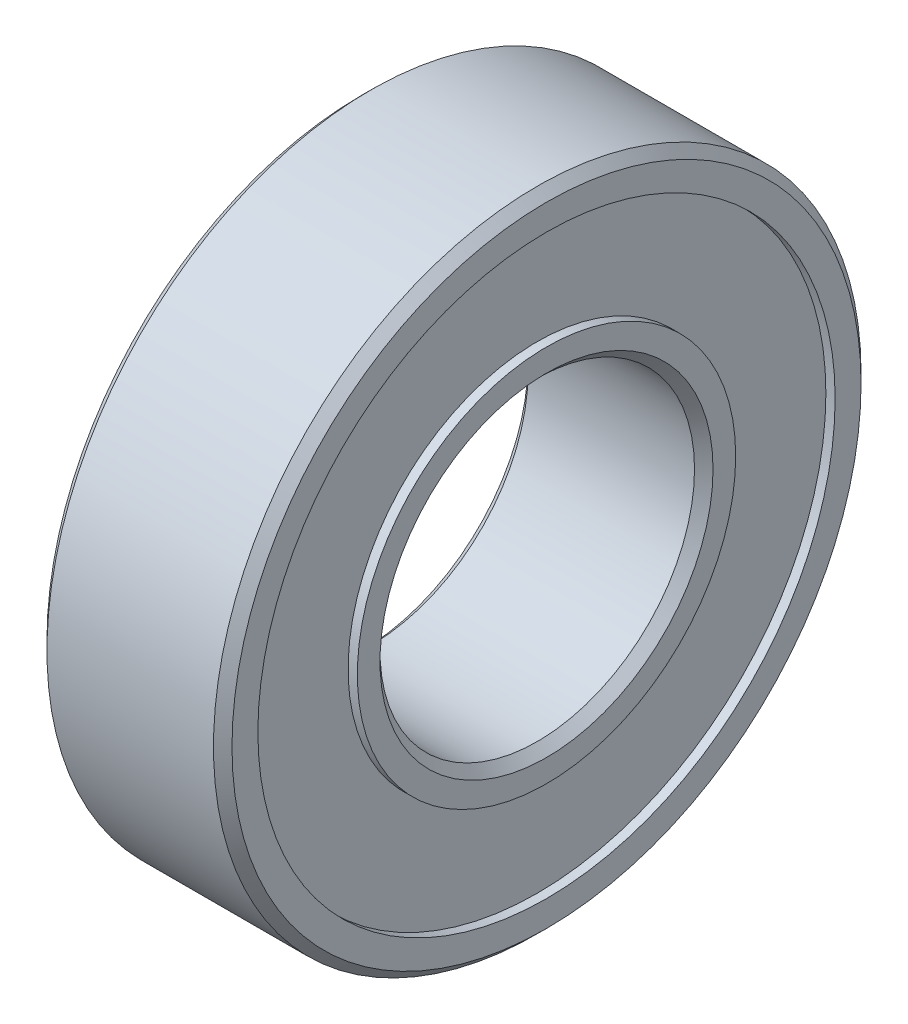
ISO-10303-21;
HEADER;
FILE_DESCRIPTION(('STEP AP214'),'2;1');
FILE_NAME('part.step','',(''),(''),'','','');
FILE_SCHEMA(('AUTOMOTIVE_DESIGN { 1 0 10303 214 1 1 1 1 }'));
ENDSEC;
DATA;
#1=APPLICATION_CONTEXT('core data for automotive mechanical design processes');
#2=APPLICATION_PROTOCOL_DEFINITION('international standard','automotive_design',2000,#1);
#3=PRODUCT_CONTEXT('',#1,'mechanical');
#4=PRODUCT('Part','Part','',(#3));
#5=PRODUCT_RELATED_PRODUCT_CATEGORY('part','',(#4));
#6=PRODUCT_DEFINITION_FORMATION('','',#4);
#7=PRODUCT_DEFINITION_CONTEXT('part definition',#1,'design');
#8=PRODUCT_DEFINITION('design','',#6,#7);
#9=PRODUCT_DEFINITION_SHAPE('','',#8);
#10=(LENGTH_UNIT() NAMED_UNIT(*) SI_UNIT(.MILLI.,.METRE.));
#11=(NAMED_UNIT(*) PLANE_ANGLE_UNIT() SI_UNIT($,.RADIAN.));
#12=(NAMED_UNIT(*) SI_UNIT($,.STERADIAN.) SOLID_ANGLE_UNIT());
#13=UNCERTAINTY_MEASURE_WITH_UNIT(LENGTH_MEASURE(1.E-05),#10,'distance_accuracy_value','');
#14=(GEOMETRIC_REPRESENTATION_CONTEXT(3) GLOBAL_UNCERTAINTY_ASSIGNED_CONTEXT((#13)) GLOBAL_UNIT_ASSIGNED_CONTEXT((#10,
#11,#12)) REPRESENTATION_CONTEXT('',''));
#15=CARTESIAN_POINT('',(0.,0.,0.));
#16=DIRECTION('',(0.,0.,1.));
#17=DIRECTION('',(1.,0.,0.));
#18=AXIS2_PLACEMENT_3D('',#15,#16,#17);
#19=CARTESIAN_POINT('',(0.,0.,0.));
#20=DIRECTION('',(1.,0.,0.));
#21=DIRECTION('',(0.,0.,-1.));
#22=AXIS2_PLACEMENT_3D('',#19,#20,#21);
#23=PLANE('',#22);
#24=CARTESIAN_POINT('',(0.,0.,0.));
#25=DIRECTION('',(1.,0.,0.));
#26=DIRECTION('',(0.,0.,-1.));
#27=AXIS2_PLACEMENT_3D('',#24,#25,#26);
#28=CIRCLE('',#27,9.00000000000001);
#29=CARTESIAN_POINT('',(0.,0.,-9.00000000000001));
#30=VERTEX_POINT('',#29);
#31=EDGE_CURVE('E60',#30,#30,#28,.T.);
#32=ORIENTED_EDGE('',*,*,#31,.T.);
#33=EDGE_LOOP('',(#32));
#34=FACE_BOUND('',#33,.T.);
#35=CARTESIAN_POINT('',(0.,0.,0.));
#36=DIRECTION('',(-1.,0.,0.));
#37=DIRECTION('',(0.,0.,1.));
#38=AXIS2_PLACEMENT_3D('',#35,#36,#37);
#39=CIRCLE('',#38,10.225);
#40=CARTESIAN_POINT('',(0.,0.,10.225));
#41=VERTEX_POINT('',#40);
#42=EDGE_CURVE('E85',#41,#41,#39,.T.);
#43=ORIENTED_EDGE('',*,*,#42,.T.);
#44=EDGE_LOOP('',(#43));
#45=FACE_BOUND('',#44,.T.);
#46=ADVANCED_FACE('F33',(#34,#45),#23,.F.);
#47=CARTESIAN_POINT('',(10.,0.,0.));
#48=DIRECTION('',(1.,0.,0.));
#49=DIRECTION('',(0.,0.,-1.));
#50=AXIS2_PLACEMENT_3D('',#47,#48,#49);
#51=PLANE('',#50);
#52=CARTESIAN_POINT('',(10.,0.,0.));
#53=DIRECTION('',(1.,0.,0.));
#54=DIRECTION('',(0.,0.,-1.));
#55=AXIS2_PLACEMENT_3D('',#52,#53,#54);
#56=CIRCLE('',#55,9.00000000000001);
#57=CARTESIAN_POINT('',(10.,0.,-9.00000000000001));
#58=VERTEX_POINT('',#57);
#59=EDGE_CURVE('E10',#58,#58,#56,.F.);
#60=ORIENTED_EDGE('',*,*,#59,.T.);
#61=EDGE_LOOP('',(#60));
#62=FACE_BOUND('',#61,.T.);
#63=CARTESIAN_POINT('',(10.,0.,0.));
#64=DIRECTION('',(1.,0.,0.));
#65=DIRECTION('',(0.,0.,-1.));
#66=AXIS2_PLACEMENT_3D('',#63,#64,#65);
#67=CIRCLE('',#66,10.225);
#68=CARTESIAN_POINT('',(10.,0.,-10.225));
#69=VERTEX_POINT('',#68);
#70=EDGE_CURVE('E73',#69,#69,#67,.T.);
#71=ORIENTED_EDGE('',*,*,#70,.T.);
#72=EDGE_LOOP('',(#71));
#73=FACE_BOUND('',#72,.T.);
#74=ADVANCED_FACE('F141',(#62,#73),#51,.T.);
#75=CARTESIAN_POINT('',(10.,0.,0.));
#76=DIRECTION('',(1.,0.,0.));
#77=DIRECTION('',(0.,0.,-1.));
#78=AXIS2_PLACEMENT_3D('',#75,#76,#77);
#79=CIRCLE('',#78,15.6);
#80=CARTESIAN_POINT('',(10.,0.,-15.6));
#81=VERTEX_POINT('',#80);
#82=EDGE_CURVE('E67',#81,#81,#79,.T.);
#83=ORIENTED_EDGE('',*,*,#82,.F.);
#84=EDGE_LOOP('',(#83));
#85=FACE_BOUND('',#84,.T.);
#86=CARTESIAN_POINT('',(10.,0.,0.));
#87=DIRECTION('',(1.,0.,0.));
#88=DIRECTION('',(0.,0.,-1.));
#89=AXIS2_PLACEMENT_3D('',#86,#87,#88);
#90=CIRCLE('',#89,17.);
#91=CARTESIAN_POINT('',(10.,0.,-17.));
#92=VERTEX_POINT('',#91);
#93=EDGE_CURVE('E41',#92,#92,#90,.T.);
#94=ORIENTED_EDGE('',*,*,#93,.T.);
#95=EDGE_LOOP('',(#94));
#96=FACE_BOUND('',#95,.T.);
#97=ADVANCED_FACE('F111',(#85,#96),#51,.T.);
#98=CARTESIAN_POINT('',(0.,0.,0.));
#99=DIRECTION('',(-1.,0.,0.));
#100=DIRECTION('',(0.,0.,1.));
#101=AXIS2_PLACEMENT_3D('',#98,#99,#100);
#102=CIRCLE('',#101,15.6);
#103=CARTESIAN_POINT('',(0.,0.,15.6));
#104=VERTEX_POINT('',#103);
#105=EDGE_CURVE('E79',#104,#104,#102,.T.);
#106=ORIENTED_EDGE('',*,*,#105,.F.);
#107=EDGE_LOOP('',(#106));
#108=FACE_BOUND('',#107,.T.);
#109=CARTESIAN_POINT('',(0.,0.,0.));
#110=DIRECTION('',(1.,0.,0.));
#111=DIRECTION('',(0.,0.,-1.));
#112=AXIS2_PLACEMENT_3D('',#109,#110,#111);
#113=CIRCLE('',#112,17.);
#114=CARTESIAN_POINT('',(0.,0.,-17.));
#115=VERTEX_POINT('',#114);
#116=EDGE_CURVE('E63',#115,#115,#113,.F.);
#117=ORIENTED_EDGE('',*,*,#116,.T.);
#118=EDGE_LOOP('',(#117));
#119=FACE_BOUND('',#118,.T.);
#120=ADVANCED_FACE('F107',(#108,#119),#23,.F.);
#121=CARTESIAN_POINT('',(10.,0.,0.));
#122=DIRECTION('',(-1.,0.,0.));
#123=DIRECTION('',(0.,0.,1.));
#124=AXIS2_PLACEMENT_3D('',#121,#122,#123);
#125=CYLINDRICAL_SURFACE('',#124,17.5);
#126=CARTESIAN_POINT('',(0.500000000000007,0.,0.));
#127=DIRECTION('',(1.,0.,0.));
#128=DIRECTION('',(0.,0.,-1.));
#129=AXIS2_PLACEMENT_3D('',#126,#127,#128);
#130=CIRCLE('',#129,17.5);
#131=CARTESIAN_POINT('',(0.500000000000007,0.,-17.5));
#132=VERTEX_POINT('',#131);
#133=EDGE_CURVE('E45',#132,#132,#130,.T.);
#134=ORIENTED_EDGE('',*,*,#133,.T.);
#135=EDGE_LOOP('',(#134));
#136=FACE_BOUND('',#135,.T.);
#137=CARTESIAN_POINT('',(9.5,0.,0.));
#138=DIRECTION('',(1.,0.,0.));
#139=DIRECTION('',(0.,0.,-1.));
#140=AXIS2_PLACEMENT_3D('',#137,#138,#139);
#141=CIRCLE('',#140,17.5);
#142=CARTESIAN_POINT('',(9.5,0.,-17.5));
#143=VERTEX_POINT('',#142);
#144=EDGE_CURVE('E49',#143,#143,#141,.F.);
#145=ORIENTED_EDGE('',*,*,#144,.T.);
#146=EDGE_LOOP('',(#145));
#147=FACE_BOUND('',#146,.T.);
#148=ADVANCED_FACE('F110',(#136,#147),#125,.T.);
#149=CARTESIAN_POINT('',(10.,0.,0.));
#150=DIRECTION('',(-1.,0.,0.));
#151=DIRECTION('',(0.,0.,1.));
#152=AXIS2_PLACEMENT_3D('',#149,#150,#151);
#153=CYLINDRICAL_SURFACE('',#152,8.5);
#154=CARTESIAN_POINT('',(0.500000000000007,0.,0.));
#155=DIRECTION('',(1.,0.,0.));
#156=DIRECTION('',(0.,0.,-1.));
#157=AXIS2_PLACEMENT_3D('',#154,#155,#156);
#158=CIRCLE('',#157,8.5);
#159=CARTESIAN_POINT('',(0.500000000000007,0.,-8.5));
#160=VERTEX_POINT('',#159);
#161=EDGE_CURVE('E54',#160,#160,#158,.F.);
#162=ORIENTED_EDGE('',*,*,#161,.T.);
#163=EDGE_LOOP('',(#162));
#164=FACE_BOUND('',#163,.T.);
#165=CARTESIAN_POINT('',(9.49999999999999,0.,0.));
#166=DIRECTION('',(1.,0.,0.));
#167=DIRECTION('',(0.,0.,-1.));
#168=AXIS2_PLACEMENT_3D('',#165,#166,#167);
#169=CIRCLE('',#168,8.5);
#170=CARTESIAN_POINT('',(9.49999999999999,0.,-8.5));
#171=VERTEX_POINT('',#170);
#172=EDGE_CURVE('E57',#171,#171,#169,.T.);
#173=ORIENTED_EDGE('',*,*,#172,.T.);
#174=EDGE_LOOP('',(#173));
#175=FACE_BOUND('',#174,.T.);
#176=ADVANCED_FACE('F125',(#164,#175),#153,.F.);
#177=CARTESIAN_POINT('',(0.,0.,0.));
#178=DIRECTION('',(-1.,0.,0.));
#179=DIRECTION('',(0.,0.,1.));
#180=AXIS2_PLACEMENT_3D('',#177,#178,#179);
#181=CONICAL_SURFACE('',#180,9.00000000000001,0.785398163397447);
#182=ORIENTED_EDGE('',*,*,#161,.F.);
#183=EDGE_LOOP('',(#182));
#184=FACE_BOUND('',#183,.T.);
#185=ORIENTED_EDGE('',*,*,#31,.F.);
#186=EDGE_LOOP('',(#185));
#187=FACE_BOUND('',#186,.T.);
#188=ADVANCED_FACE('F119',(#184,#187),#181,.F.);
#189=CARTESIAN_POINT('',(0.500000000000007,0.,0.));
#190=DIRECTION('',(1.,0.,0.));
#191=DIRECTION('',(0.,0.,-1.));
#192=AXIS2_PLACEMENT_3D('',#189,#190,#191);
#193=CONICAL_SURFACE('',#192,17.5,0.785398163397448);
#194=ORIENTED_EDGE('',*,*,#116,.F.);
#195=EDGE_LOOP('',(#194));
#196=FACE_BOUND('',#195,.T.);
#197=ORIENTED_EDGE('',*,*,#133,.F.);
#198=EDGE_LOOP('',(#197));
#199=FACE_BOUND('',#198,.T.);
#200=ADVANCED_FACE('F115',(#196,#199),#193,.T.);
#201=CARTESIAN_POINT('',(9.49999999999999,0.,0.));
#202=DIRECTION('',(1.,0.,0.));
#203=DIRECTION('',(0.,0.,-1.));
#204=AXIS2_PLACEMENT_3D('',#201,#202,#203);
#205=CONICAL_SURFACE('',#204,8.5,0.785398163397447);
#206=ORIENTED_EDGE('',*,*,#59,.F.);
#207=EDGE_LOOP('',(#206));
#208=FACE_BOUND('',#207,.T.);
#209=ORIENTED_EDGE('',*,*,#172,.F.);
#210=EDGE_LOOP('',(#209));
#211=FACE_BOUND('',#210,.T.);
#212=ADVANCED_FACE('F118',(#208,#211),#205,.F.);
#213=CARTESIAN_POINT('',(10.,0.,0.));
#214=DIRECTION('',(-1.,0.,0.));
#215=DIRECTION('',(0.,0.,1.));
#216=AXIS2_PLACEMENT_3D('',#213,#214,#215);
#217=CONICAL_SURFACE('',#216,17.,0.785398163397441);
#218=ORIENTED_EDGE('',*,*,#144,.F.);
#219=EDGE_LOOP('',(#218));
#220=FACE_BOUND('',#219,.T.);
#221=ORIENTED_EDGE('',*,*,#93,.F.);
#222=EDGE_LOOP('',(#221));
#223=FACE_BOUND('',#222,.T.);
#224=ADVANCED_FACE('F36',(#220,#223),#217,.T.);
#225=CARTESIAN_POINT('',(9.5,0.,0.));
#226=DIRECTION('',(1.,0.,0.));
#227=DIRECTION('',(0.,0.,-1.));
#228=AXIS2_PLACEMENT_3D('',#225,#226,#227);
#229=CYLINDRICAL_SURFACE('',#228,15.6);
#230=CARTESIAN_POINT('',(9.5,0.,0.));
#231=DIRECTION('',(1.,0.,0.));
#232=DIRECTION('',(0.,0.,-1.));
#233=AXIS2_PLACEMENT_3D('',#230,#231,#232);
#234=CIRCLE('',#233,15.6);
#235=CARTESIAN_POINT('',(9.5,0.,-15.6));
#236=VERTEX_POINT('',#235);
#237=EDGE_CURVE('E66',#236,#236,#234,.T.);
#238=ORIENTED_EDGE('',*,*,#237,.F.);
#239=EDGE_LOOP('',(#238));
#240=FACE_BOUND('',#239,.T.);
#241=ORIENTED_EDGE('',*,*,#82,.T.);
#242=EDGE_LOOP('',(#241));
#243=FACE_BOUND('',#242,.T.);
#244=ADVANCED_FACE('F131',(#240,#243),#229,.F.);
#245=CARTESIAN_POINT('',(9.5,0.,0.));
#246=DIRECTION('',(1.,0.,0.));
#247=DIRECTION('',(0.,0.,-1.));
#248=AXIS2_PLACEMENT_3D('',#245,#246,#247);
#249=PLANE('',#248);
#250=CARTESIAN_POINT('',(9.5,0.,0.));
#251=DIRECTION('',(1.,0.,0.));
#252=DIRECTION('',(0.,0.,-1.));
#253=AXIS2_PLACEMENT_3D('',#250,#251,#252);
#254=CIRCLE('',#253,10.225);
#255=CARTESIAN_POINT('',(9.5,0.,-10.225));
#256=VERTEX_POINT('',#255);
#257=EDGE_CURVE('E70',#256,#256,#254,.T.);
#258=ORIENTED_EDGE('',*,*,#257,.F.);
#259=EDGE_LOOP('',(#258));
#260=FACE_BOUND('',#259,.T.);
#261=ORIENTED_EDGE('',*,*,#237,.T.);
#262=EDGE_LOOP('',(#261));
#263=FACE_BOUND('',#262,.T.);
#264=ADVANCED_FACE('F136',(#260,#263),#249,.T.);
#265=CARTESIAN_POINT('',(9.5,0.,0.));
#266=DIRECTION('',(1.,0.,0.));
#267=DIRECTION('',(0.,0.,-1.));
#268=AXIS2_PLACEMENT_3D('',#265,#266,#267);
#269=CYLINDRICAL_SURFACE('',#268,10.225);
#270=ORIENTED_EDGE('',*,*,#257,.T.);
#271=EDGE_LOOP('',(#270));
#272=FACE_BOUND('',#271,.T.);
#273=ORIENTED_EDGE('',*,*,#70,.F.);
#274=EDGE_LOOP('',(#273));
#275=FACE_BOUND('',#274,.T.);
#276=ADVANCED_FACE('F103',(#272,#275),#269,.T.);
#277=CARTESIAN_POINT('',(0.5,0.,0.));
#278=DIRECTION('',(-1.,0.,0.));
#279=DIRECTION('',(0.,0.,1.));
#280=AXIS2_PLACEMENT_3D('',#277,#278,#279);
#281=CYLINDRICAL_SURFACE('',#280,15.6);
#282=CARTESIAN_POINT('',(0.5,0.,0.));
#283=DIRECTION('',(-1.,0.,0.));
#284=DIRECTION('',(0.,0.,1.));
#285=AXIS2_PLACEMENT_3D('',#282,#283,#284);
#286=CIRCLE('',#285,15.6);
#287=CARTESIAN_POINT('',(0.5,0.,15.6));
#288=VERTEX_POINT('',#287);
#289=EDGE_CURVE('E76',#288,#288,#286,.T.);
#290=ORIENTED_EDGE('',*,*,#289,.F.);
#291=EDGE_LOOP('',(#290));
#292=FACE_BOUND('',#291,.T.);
#293=ORIENTED_EDGE('',*,*,#105,.T.);
#294=EDGE_LOOP('',(#293));
#295=FACE_BOUND('',#294,.T.);
#296=ADVANCED_FACE('F97',(#292,#295),#281,.F.);
#297=CARTESIAN_POINT('',(0.5,0.,0.));
#298=DIRECTION('',(-1.,0.,0.));
#299=DIRECTION('',(0.,0.,1.));
#300=AXIS2_PLACEMENT_3D('',#297,#298,#299);
#301=PLANE('',#300);
#302=CARTESIAN_POINT('',(0.5,0.,0.));
#303=DIRECTION('',(-1.,0.,0.));
#304=DIRECTION('',(0.,0.,1.));
#305=AXIS2_PLACEMENT_3D('',#302,#303,#304);
#306=CIRCLE('',#305,10.225);
#307=CARTESIAN_POINT('',(0.5,0.,10.225));
#308=VERTEX_POINT('',#307);
#309=EDGE_CURVE('E82',#308,#308,#306,.T.);
#310=ORIENTED_EDGE('',*,*,#309,.F.);
#311=EDGE_LOOP('',(#310));
#312=FACE_BOUND('',#311,.T.);
#313=ORIENTED_EDGE('',*,*,#289,.T.);
#314=EDGE_LOOP('',(#313));
#315=FACE_BOUND('',#314,.T.);
#316=ADVANCED_FACE('F94',(#312,#315),#301,.T.);
#317=CARTESIAN_POINT('',(0.5,0.,0.));
#318=DIRECTION('',(-1.,0.,0.));
#319=DIRECTION('',(0.,0.,1.));
#320=AXIS2_PLACEMENT_3D('',#317,#318,#319);
#321=CYLINDRICAL_SURFACE('',#320,10.225);
#322=ORIENTED_EDGE('',*,*,#309,.T.);
#323=EDGE_LOOP('',(#322));
#324=FACE_BOUND('',#323,.T.);
#325=ORIENTED_EDGE('',*,*,#42,.F.);
#326=EDGE_LOOP('',(#325));
#327=FACE_BOUND('',#326,.T.);
#328=ADVANCED_FACE('F91',(#324,#327),#321,.T.);
#329=CLOSED_SHELL('',(#46,#74,#97,#120,#148,#176,#188,#200,#212,#224,#244,#264,#276,#296,#316,#328));
#330=MANIFOLD_SOLID_BREP('B2',#329);
#331=ADVANCED_BREP_SHAPE_REPRESENTATION('',(#18,#330),#14);
#332=SHAPE_DEFINITION_REPRESENTATION(#9,#331);
ENDSEC;
END-ISO-10303-21;
